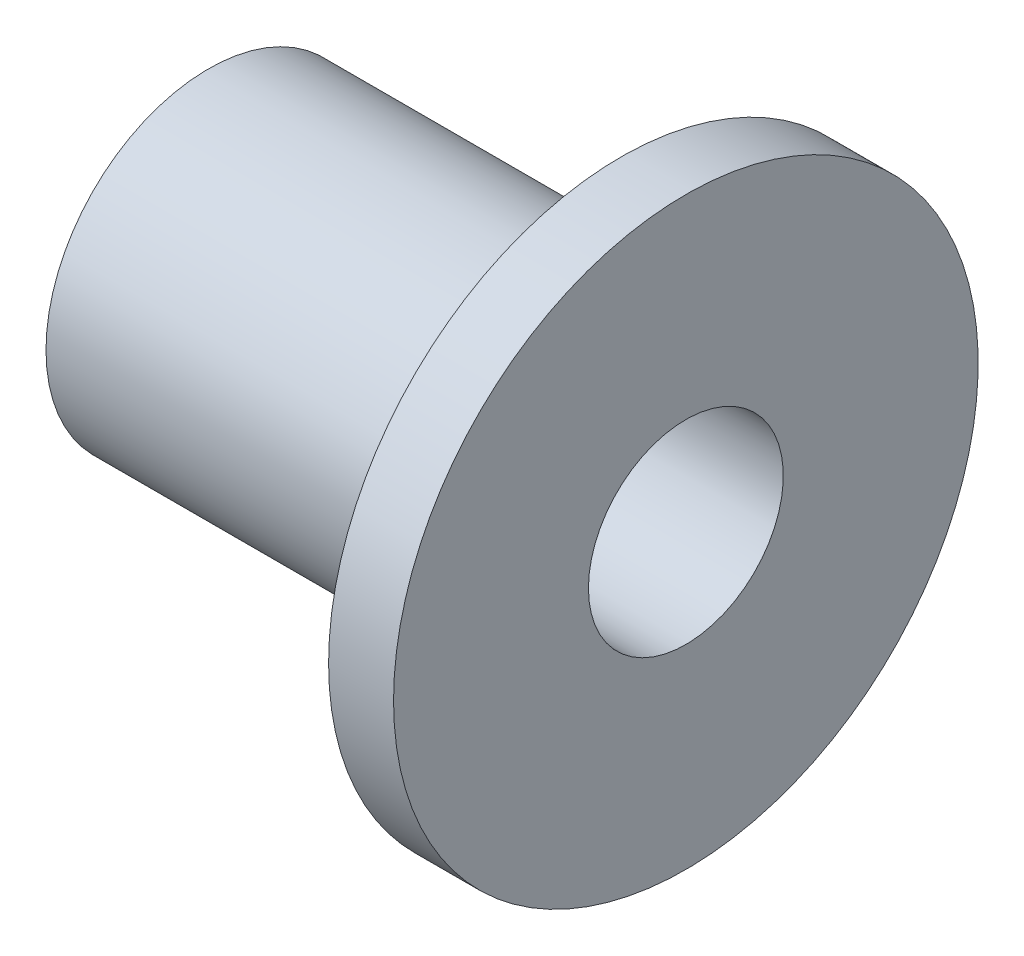
ISO-10303-21;
HEADER;
FILE_DESCRIPTION(('STEP AP214'),'2;1');
FILE_NAME('part.step','',(''),(''),'','','');
FILE_SCHEMA(('AUTOMOTIVE_DESIGN { 1 0 10303 214 1 1 1 1 }'));
ENDSEC;
DATA;
#1=APPLICATION_CONTEXT('core data for automotive mechanical design processes');
#2=APPLICATION_PROTOCOL_DEFINITION('international standard','automotive_design',2000,#1);
#3=PRODUCT_CONTEXT('',#1,'mechanical');
#4=PRODUCT('Part','Part','',(#3));
#5=PRODUCT_RELATED_PRODUCT_CATEGORY('part','',(#4));
#6=PRODUCT_DEFINITION_FORMATION('','',#4);
#7=PRODUCT_DEFINITION_CONTEXT('part definition',#1,'design');
#8=PRODUCT_DEFINITION('design','',#6,#7);
#9=PRODUCT_DEFINITION_SHAPE('','',#8);
#10=(LENGTH_UNIT() NAMED_UNIT(*) SI_UNIT(.MILLI.,.METRE.));
#11=(NAMED_UNIT(*) PLANE_ANGLE_UNIT() SI_UNIT($,.RADIAN.));
#12=(NAMED_UNIT(*) SI_UNIT($,.STERADIAN.) SOLID_ANGLE_UNIT());
#13=UNCERTAINTY_MEASURE_WITH_UNIT(LENGTH_MEASURE(1.E-05),#10,'distance_accuracy_value','');
#14=(GEOMETRIC_REPRESENTATION_CONTEXT(3) GLOBAL_UNCERTAINTY_ASSIGNED_CONTEXT((#13)) GLOBAL_UNIT_ASSIGNED_CONTEXT((#10,
#11,#12)) REPRESENTATION_CONTEXT('',''));
#15=CARTESIAN_POINT('',(0.,0.,0.));
#16=DIRECTION('',(0.,0.,1.));
#17=DIRECTION('',(1.,0.,0.));
#18=AXIS2_PLACEMENT_3D('',#15,#16,#17);
#19=CARTESIAN_POINT('',(0.,5.,0.));
#20=DIRECTION('',(1.,0.,0.));
#21=DIRECTION('',(0.,0.,-1.));
#22=AXIS2_PLACEMENT_3D('',#19,#20,#21);
#23=PLANE('',#22);
#24=CARTESIAN_POINT('',(0.,0.,0.));
#25=DIRECTION('',(-1.,0.,0.));
#26=DIRECTION('',(0.,0.,1.));
#27=AXIS2_PLACEMENT_3D('',#24,#25,#26);
#28=CIRCLE('',#27,3.);
#29=CARTESIAN_POINT('',(0.,0.,3.));
#30=VERTEX_POINT('',#29);
#31=EDGE_CURVE('E10',#30,#30,#28,.T.);
#32=ORIENTED_EDGE('',*,*,#31,.F.);
#33=EDGE_LOOP('',(#32));
#34=FACE_BOUND('',#33,.T.);
#35=CARTESIAN_POINT('',(0.,0.,0.));
#36=DIRECTION('',(-1.,0.,0.));
#37=DIRECTION('',(0.,0.,1.));
#38=AXIS2_PLACEMENT_3D('',#35,#36,#37);
#39=CIRCLE('',#38,5.);
#40=CARTESIAN_POINT('',(0.,0.,5.));
#41=VERTEX_POINT('',#40);
#42=EDGE_CURVE('E64',#41,#41,#39,.T.);
#43=ORIENTED_EDGE('',*,*,#42,.T.);
#44=EDGE_LOOP('',(#43));
#45=FACE_BOUND('',#44,.T.);
#46=ADVANCED_FACE('F37',(#34,#45),#23,.F.);
#47=CARTESIAN_POINT('',(0.,0.,0.));
#48=DIRECTION('',(-1.,0.,0.));
#49=DIRECTION('',(0.,0.,1.));
#50=AXIS2_PLACEMENT_3D('',#47,#48,#49);
#51=CYLINDRICAL_SURFACE('',#50,3.);
#52=CARTESIAN_POINT('',(14.7,0.,0.));
#53=DIRECTION('',(-1.,0.,0.));
#54=DIRECTION('',(0.,0.,1.));
#55=AXIS2_PLACEMENT_3D('',#52,#53,#54);
#56=CIRCLE('',#55,3.);
#57=CARTESIAN_POINT('',(14.7,0.,3.));
#58=VERTEX_POINT('',#57);
#59=EDGE_CURVE('E44',#58,#58,#56,.T.);
#60=ORIENTED_EDGE('',*,*,#59,.F.);
#61=EDGE_LOOP('',(#60));
#62=FACE_BOUND('',#61,.T.);
#63=ORIENTED_EDGE('',*,*,#31,.T.);
#64=EDGE_LOOP('',(#63));
#65=FACE_BOUND('',#64,.T.);
#66=ADVANCED_FACE('F90',(#62,#65),#51,.F.);
#67=CARTESIAN_POINT('',(14.7,3.,0.));
#68=DIRECTION('',(-1.,0.,0.));
#69=DIRECTION('',(0.,0.,1.));
#70=AXIS2_PLACEMENT_3D('',#67,#68,#69);
#71=PLANE('',#70);
#72=CARTESIAN_POINT('',(14.7,0.,0.));
#73=DIRECTION('',(-1.,0.,0.));
#74=DIRECTION('',(0.,0.,1.));
#75=AXIS2_PLACEMENT_3D('',#72,#73,#74);
#76=CIRCLE('',#75,9.);
#77=CARTESIAN_POINT('',(14.7,0.,9.));
#78=VERTEX_POINT('',#77);
#79=EDGE_CURVE('E49',#78,#78,#76,.T.);
#80=ORIENTED_EDGE('',*,*,#79,.F.);
#81=EDGE_LOOP('',(#80));
#82=FACE_BOUND('',#81,.T.);
#83=ORIENTED_EDGE('',*,*,#59,.T.);
#84=EDGE_LOOP('',(#83));
#85=FACE_BOUND('',#84,.T.);
#86=ADVANCED_FACE('F85',(#82,#85),#71,.F.);
#87=CARTESIAN_POINT('',(0.,0.,0.));
#88=DIRECTION('',(-1.,0.,0.));
#89=DIRECTION('',(0.,0.,1.));
#90=AXIS2_PLACEMENT_3D('',#87,#88,#89);
#91=CYLINDRICAL_SURFACE('',#90,9.);
#92=CARTESIAN_POINT('',(12.7,0.,0.));
#93=DIRECTION('',(-1.,0.,0.));
#94=DIRECTION('',(0.,0.,1.));
#95=AXIS2_PLACEMENT_3D('',#92,#93,#94);
#96=CIRCLE('',#95,9.);
#97=CARTESIAN_POINT('',(12.7,0.,9.));
#98=VERTEX_POINT('',#97);
#99=EDGE_CURVE('E54',#98,#98,#96,.T.);
#100=ORIENTED_EDGE('',*,*,#99,.F.);
#101=EDGE_LOOP('',(#100));
#102=FACE_BOUND('',#101,.T.);
#103=ORIENTED_EDGE('',*,*,#79,.T.);
#104=EDGE_LOOP('',(#103));
#105=FACE_BOUND('',#104,.T.);
#106=ADVANCED_FACE('F79',(#102,#105),#91,.T.);
#107=CARTESIAN_POINT('',(12.7,9.,0.));
#108=DIRECTION('',(1.,0.,0.));
#109=DIRECTION('',(0.,0.,-1.));
#110=AXIS2_PLACEMENT_3D('',#107,#108,#109);
#111=PLANE('',#110);
#112=CARTESIAN_POINT('',(12.7,0.,0.));
#113=DIRECTION('',(-1.,0.,0.));
#114=DIRECTION('',(0.,0.,1.));
#115=AXIS2_PLACEMENT_3D('',#112,#113,#114);
#116=CIRCLE('',#115,5.);
#117=CARTESIAN_POINT('',(12.7,0.,5.));
#118=VERTEX_POINT('',#117);
#119=EDGE_CURVE('E60',#118,#118,#116,.T.);
#120=ORIENTED_EDGE('',*,*,#119,.F.);
#121=EDGE_LOOP('',(#120));
#122=FACE_BOUND('',#121,.T.);
#123=ORIENTED_EDGE('',*,*,#99,.T.);
#124=EDGE_LOOP('',(#123));
#125=FACE_BOUND('',#124,.T.);
#126=ADVANCED_FACE('F73',(#122,#125),#111,.F.);
#127=CARTESIAN_POINT('',(0.,0.,0.));
#128=DIRECTION('',(-1.,0.,0.));
#129=DIRECTION('',(0.,0.,1.));
#130=AXIS2_PLACEMENT_3D('',#127,#128,#129);
#131=CYLINDRICAL_SURFACE('',#130,5.);
#132=ORIENTED_EDGE('',*,*,#42,.F.);
#133=EDGE_LOOP('',(#132));
#134=FACE_BOUND('',#133,.T.);
#135=ORIENTED_EDGE('',*,*,#119,.T.);
#136=EDGE_LOOP('',(#135));
#137=FACE_BOUND('',#136,.T.);
#138=ADVANCED_FACE('F70',(#134,#137),#131,.T.);
#139=CLOSED_SHELL('',(#46,#66,#86,#106,#126,#138));
#140=MANIFOLD_SOLID_BREP('B2',#139);
#141=ADVANCED_BREP_SHAPE_REPRESENTATION('',(#18,#140),#14);
#142=SHAPE_DEFINITION_REPRESENTATION(#9,#141);
ENDSEC;
END-ISO-10303-21;
